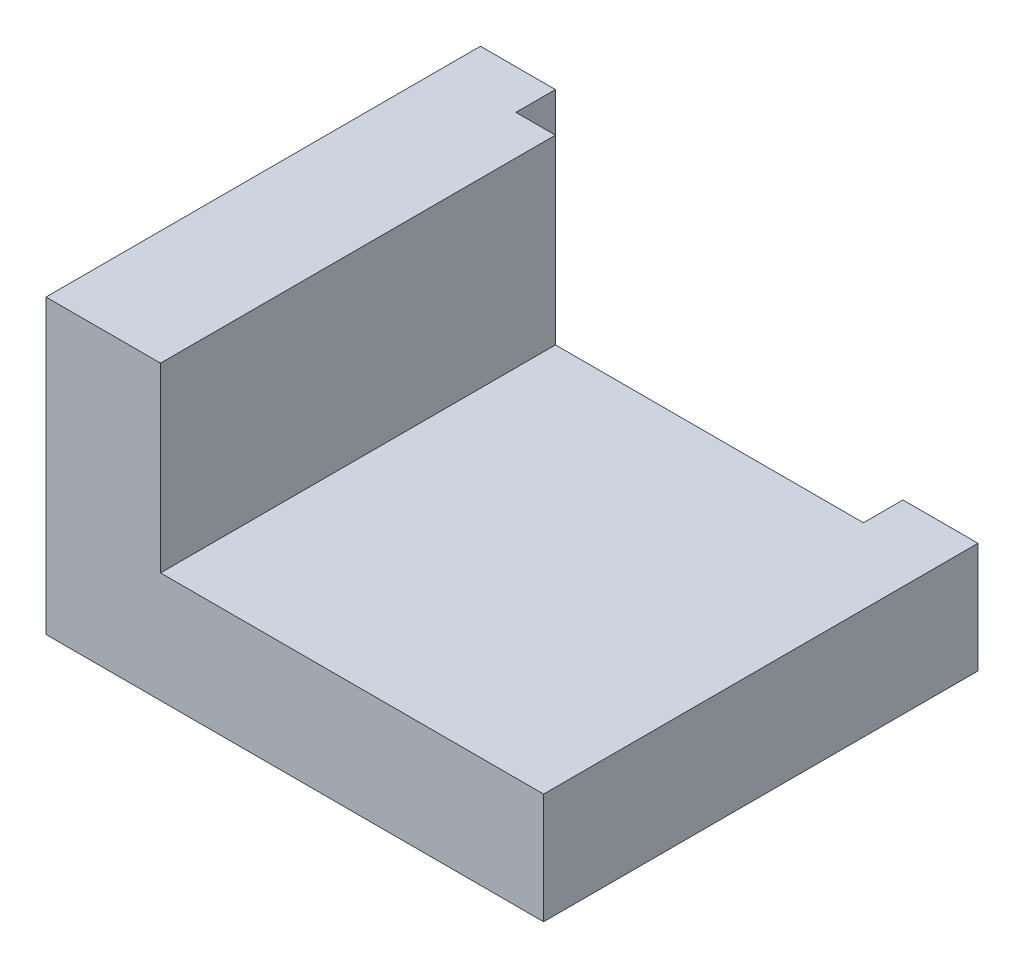
ISO-10303-21;
HEADER;
FILE_DESCRIPTION(('STEP AP214'),'2;1');
FILE_NAME('part.step','',(''),(''),'','','');
FILE_SCHEMA(('AUTOMOTIVE_DESIGN { 1 0 10303 214 1 1 1 1 }'));
ENDSEC;
DATA;
#1=APPLICATION_CONTEXT('core data for automotive mechanical design processes');
#2=APPLICATION_PROTOCOL_DEFINITION('international standard','automotive_design',2000,#1);
#3=PRODUCT_CONTEXT('',#1,'mechanical');
#4=PRODUCT('Part','Part','',(#3));
#5=PRODUCT_RELATED_PRODUCT_CATEGORY('part','',(#4));
#6=PRODUCT_DEFINITION_FORMATION('','',#4);
#7=PRODUCT_DEFINITION_CONTEXT('part definition',#1,'design');
#8=PRODUCT_DEFINITION('design','',#6,#7);
#9=PRODUCT_DEFINITION_SHAPE('','',#8);
#10=(LENGTH_UNIT() NAMED_UNIT(*) SI_UNIT(.MILLI.,.METRE.));
#11=(NAMED_UNIT(*) PLANE_ANGLE_UNIT() SI_UNIT($,.RADIAN.));
#12=(NAMED_UNIT(*) SI_UNIT($,.STERADIAN.) SOLID_ANGLE_UNIT());
#13=UNCERTAINTY_MEASURE_WITH_UNIT(LENGTH_MEASURE(1.E-05),#10,'distance_accuracy_value','');
#14=(GEOMETRIC_REPRESENTATION_CONTEXT(3) GLOBAL_UNCERTAINTY_ASSIGNED_CONTEXT((#13)) GLOBAL_UNIT_ASSIGNED_CONTEXT((#10,
#11,#12)) REPRESENTATION_CONTEXT('',''));
#15=CARTESIAN_POINT('',(0.,0.,0.));
#16=DIRECTION('',(0.,0.,1.));
#17=DIRECTION('',(1.,0.,0.));
#18=AXIS2_PLACEMENT_3D('',#15,#16,#17);
#19=CARTESIAN_POINT('',(63.,0.,5.));
#20=DIRECTION('',(0.,1.,0.));
#21=DIRECTION('',(-1.,0.,0.));
#22=AXIS2_PLACEMENT_3D('',#19,#20,#21);
#23=PLANE('',#22);
#24=DIRECTION('',(1.,0.,0.));
#25=VECTOR('',#24,1.);
#26=CARTESIAN_POINT('',(63.,0.,0.));
#27=LINE('',#26,#25);
#28=CARTESIAN_POINT('',(0.,0.,0.));
#29=VERTEX_POINT('',#28);
#30=CARTESIAN_POINT('',(63.,0.,0.));
#31=VERTEX_POINT('',#30);
#32=EDGE_CURVE('E160',#29,#31,#27,.T.);
#33=ORIENTED_EDGE('',*,*,#32,.T.);
#34=DIRECTION('',(0.,0.,-1.));
#35=VECTOR('',#34,1.);
#36=CARTESIAN_POINT('',(63.,0.,5.));
#37=LINE('',#36,#35);
#38=CARTESIAN_POINT('',(63.,0.,55.));
#39=VERTEX_POINT('',#38);
#40=EDGE_CURVE('E11',#39,#31,#37,.T.);
#41=ORIENTED_EDGE('',*,*,#40,.F.);
#42=DIRECTION('',(1.,0.,0.));
#43=VECTOR('',#42,1.);
#44=CARTESIAN_POINT('',(63.,0.,55.));
#45=LINE('',#44,#43);
#46=CARTESIAN_POINT('',(0.,0.,55.));
#47=VERTEX_POINT('',#46);
#48=EDGE_CURVE('E129',#47,#39,#45,.T.);
#49=ORIENTED_EDGE('',*,*,#48,.F.);
#50=DIRECTION('',(0.,0.,-1.));
#51=VECTOR('',#50,1.);
#52=CARTESIAN_POINT('',(0.,0.,5.));
#53=LINE('',#52,#51);
#54=EDGE_CURVE('E117',#47,#29,#53,.T.);
#55=ORIENTED_EDGE('',*,*,#54,.T.);
#56=EDGE_LOOP('',(#33,#41,#49,#55));
#57=FACE_BOUND('',#56,.T.);
#58=ADVANCED_FACE('F33',(#57),#23,.F.);
#59=CARTESIAN_POINT('',(63.,14.,5.));
#60=DIRECTION('',(-1.,0.,0.));
#61=DIRECTION('',(0.,0.,1.));
#62=AXIS2_PLACEMENT_3D('',#59,#60,#61);
#63=PLANE('',#62);
#64=DIRECTION('',(0.,1.,0.));
#65=VECTOR('',#64,1.);
#66=CARTESIAN_POINT('',(63.,14.,0.));
#67=LINE('',#66,#65);
#68=CARTESIAN_POINT('',(63.,14.,0.));
#69=VERTEX_POINT('',#68);
#70=EDGE_CURVE('E170',#31,#69,#67,.T.);
#71=ORIENTED_EDGE('',*,*,#70,.T.);
#72=DIRECTION('',(0.,0.,-1.));
#73=VECTOR('',#72,1.);
#74=CARTESIAN_POINT('',(63.,14.,5.));
#75=LINE('',#74,#73);
#76=CARTESIAN_POINT('',(63.,14.,55.));
#77=VERTEX_POINT('',#76);
#78=EDGE_CURVE('E41',#77,#69,#75,.T.);
#79=ORIENTED_EDGE('',*,*,#78,.F.);
#80=DIRECTION('',(0.,1.,0.));
#81=VECTOR('',#80,1.);
#82=CARTESIAN_POINT('',(63.,14.,55.));
#83=LINE('',#82,#81);
#84=EDGE_CURVE('E133',#39,#77,#83,.T.);
#85=ORIENTED_EDGE('',*,*,#84,.F.);
#86=ORIENTED_EDGE('',*,*,#40,.T.);
#87=EDGE_LOOP('',(#71,#79,#85,#86));
#88=FACE_BOUND('',#87,.T.);
#89=ADVANCED_FACE('F212',(#88),#63,.F.);
#90=CARTESIAN_POINT('',(53.5,14.,5.));
#91=DIRECTION('',(0.,-1.,0.));
#92=DIRECTION('',(1.,0.,0.));
#93=AXIS2_PLACEMENT_3D('',#90,#91,#92);
#94=PLANE('',#93);
#95=DIRECTION('',(-1.,0.,0.));
#96=VECTOR('',#95,1.);
#97=CARTESIAN_POINT('',(53.5,14.,0.));
#98=LINE('',#97,#96);
#99=CARTESIAN_POINT('',(53.5,14.,0.));
#100=VERTEX_POINT('',#99);
#101=EDGE_CURVE('E172',#69,#100,#98,.T.);
#102=ORIENTED_EDGE('',*,*,#101,.T.);
#103=DIRECTION('',(0.,0.,-1.));
#104=VECTOR('',#103,1.);
#105=CARTESIAN_POINT('',(53.5,14.,5.));
#106=LINE('',#105,#104);
#107=CARTESIAN_POINT('',(53.5,14.,5.));
#108=VERTEX_POINT('',#107);
#109=EDGE_CURVE('E91',#108,#100,#106,.T.);
#110=ORIENTED_EDGE('',*,*,#109,.F.);
#111=DIRECTION('',(-1.,0.,0.));
#112=VECTOR('',#111,1.);
#113=CARTESIAN_POINT('',(14.5,14.,5.));
#114=LINE('',#113,#112);
#115=CARTESIAN_POINT('',(14.5,14.,5.));
#116=VERTEX_POINT('',#115);
#117=EDGE_CURVE('E152',#108,#116,#114,.T.);
#118=ORIENTED_EDGE('',*,*,#117,.T.);
#119=DIRECTION('',(0.,0.,-1.));
#120=VECTOR('',#119,1.);
#121=CARTESIAN_POINT('',(14.5,14.,55.));
#122=LINE('',#121,#120);
#123=CARTESIAN_POINT('',(14.5,14.,55.));
#124=VERTEX_POINT('',#123);
#125=EDGE_CURVE('E157',#124,#116,#122,.T.);
#126=ORIENTED_EDGE('',*,*,#125,.F.);
#127=DIRECTION('',(-1.,0.,0.));
#128=VECTOR('',#127,1.);
#129=CARTESIAN_POINT('',(14.5,14.,55.));
#130=LINE('',#129,#128);
#131=EDGE_CURVE('E146',#77,#124,#130,.T.);
#132=ORIENTED_EDGE('',*,*,#131,.F.);
#133=ORIENTED_EDGE('',*,*,#78,.T.);
#134=EDGE_LOOP('',(#102,#110,#118,#126,#132,#133));
#135=FACE_BOUND('',#134,.T.);
#136=ADVANCED_FACE('F192',(#135),#94,.F.);
#137=CARTESIAN_POINT('',(53.5,3.99999999999999,5.));
#138=DIRECTION('',(1.,0.,0.));
#139=DIRECTION('',(0.,0.,-1.));
#140=AXIS2_PLACEMENT_3D('',#137,#138,#139);
#141=PLANE('',#140);
#142=DIRECTION('',(0.,-1.,0.));
#143=VECTOR('',#142,1.);
#144=CARTESIAN_POINT('',(53.5,3.99999999999999,0.));
#145=LINE('',#144,#143);
#146=CARTESIAN_POINT('',(53.5,3.99999999999999,0.));
#147=VERTEX_POINT('',#146);
#148=EDGE_CURVE('E174',#100,#147,#145,.T.);
#149=ORIENTED_EDGE('',*,*,#148,.T.);
#150=DIRECTION('',(0.,0.,-1.));
#151=VECTOR('',#150,1.);
#152=CARTESIAN_POINT('',(53.5,3.99999999999999,5.));
#153=LINE('',#152,#151);
#154=CARTESIAN_POINT('',(53.5,3.99999999999999,5.));
#155=VERTEX_POINT('',#154);
#156=EDGE_CURVE('E186',#155,#147,#153,.T.);
#157=ORIENTED_EDGE('',*,*,#156,.F.);
#158=DIRECTION('',(0.,-1.,0.));
#159=VECTOR('',#158,1.);
#160=CARTESIAN_POINT('',(53.5,3.99999999999999,5.));
#161=LINE('',#160,#159);
#162=EDGE_CURVE('E161',#108,#155,#161,.T.);
#163=ORIENTED_EDGE('',*,*,#162,.F.);
#164=ORIENTED_EDGE('',*,*,#109,.T.);
#165=EDGE_LOOP('',(#149,#157,#163,#164));
#166=FACE_BOUND('',#165,.T.);
#167=ADVANCED_FACE('F201',(#166),#141,.F.);
#168=CARTESIAN_POINT('',(9.5,3.99999999999999,5.));
#169=DIRECTION('',(0.,-1.,0.));
#170=DIRECTION('',(0.,0.,-1.));
#171=AXIS2_PLACEMENT_3D('',#168,#169,#170);
#172=PLANE('',#171);
#173=DIRECTION('',(-1.,0.,0.));
#174=VECTOR('',#173,1.);
#175=CARTESIAN_POINT('',(9.5,3.99999999999999,0.));
#176=LINE('',#175,#174);
#177=CARTESIAN_POINT('',(9.5,3.99999999999999,0.));
#178=VERTEX_POINT('',#177);
#179=EDGE_CURVE('E176',#147,#178,#176,.T.);
#180=ORIENTED_EDGE('',*,*,#179,.T.);
#181=DIRECTION('',(0.,0.,-1.));
#182=VECTOR('',#181,1.);
#183=CARTESIAN_POINT('',(9.5,3.99999999999999,5.));
#184=LINE('',#183,#182);
#185=CARTESIAN_POINT('',(9.5,3.99999999999999,5.));
#186=VERTEX_POINT('',#185);
#187=EDGE_CURVE('E49',#186,#178,#184,.T.);
#188=ORIENTED_EDGE('',*,*,#187,.F.);
#189=DIRECTION('',(-1.,0.,0.));
#190=VECTOR('',#189,1.);
#191=CARTESIAN_POINT('',(9.5,3.99999999999999,5.));
#192=LINE('',#191,#190);
#193=EDGE_CURVE('E164',#155,#186,#192,.T.);
#194=ORIENTED_EDGE('',*,*,#193,.F.);
#195=ORIENTED_EDGE('',*,*,#156,.T.);
#196=EDGE_LOOP('',(#180,#188,#194,#195));
#197=FACE_BOUND('',#196,.T.);
#198=ADVANCED_FACE('F202',(#197),#172,.F.);
#199=CARTESIAN_POINT('',(9.5,37.,5.));
#200=DIRECTION('',(-1.,0.,0.));
#201=DIRECTION('',(0.,-1.,0.));
#202=AXIS2_PLACEMENT_3D('',#199,#200,#201);
#203=PLANE('',#202);
#204=DIRECTION('',(0.,1.,0.));
#205=VECTOR('',#204,1.);
#206=CARTESIAN_POINT('',(9.5,37.,0.));
#207=LINE('',#206,#205);
#208=CARTESIAN_POINT('',(9.5,37.,0.));
#209=VERTEX_POINT('',#208);
#210=EDGE_CURVE('E178',#178,#209,#207,.T.);
#211=ORIENTED_EDGE('',*,*,#210,.T.);
#212=DIRECTION('',(0.,0.,-1.));
#213=VECTOR('',#212,1.);
#214=CARTESIAN_POINT('',(9.5,37.,5.));
#215=LINE('',#214,#213);
#216=CARTESIAN_POINT('',(9.5,37.,5.));
#217=VERTEX_POINT('',#216);
#218=EDGE_CURVE('E183',#217,#209,#215,.T.);
#219=ORIENTED_EDGE('',*,*,#218,.F.);
#220=DIRECTION('',(0.,1.,0.));
#221=VECTOR('',#220,1.);
#222=CARTESIAN_POINT('',(9.5,37.,5.));
#223=LINE('',#222,#221);
#224=EDGE_CURVE('E126',#186,#217,#223,.T.);
#225=ORIENTED_EDGE('',*,*,#224,.F.);
#226=ORIENTED_EDGE('',*,*,#187,.T.);
#227=EDGE_LOOP('',(#211,#219,#225,#226));
#228=FACE_BOUND('',#227,.T.);
#229=ADVANCED_FACE('F214',(#228),#203,.F.);
#230=CARTESIAN_POINT('',(0.,37.,5.));
#231=DIRECTION('',(0.,-1.,0.));
#232=DIRECTION('',(1.,0.,0.));
#233=AXIS2_PLACEMENT_3D('',#230,#231,#232);
#234=PLANE('',#233);
#235=DIRECTION('',(-1.,0.,0.));
#236=VECTOR('',#235,1.);
#237=CARTESIAN_POINT('',(0.,37.,0.));
#238=LINE('',#237,#236);
#239=CARTESIAN_POINT('',(0.,37.,0.));
#240=VERTEX_POINT('',#239);
#241=EDGE_CURVE('E79',#209,#240,#238,.T.);
#242=ORIENTED_EDGE('',*,*,#241,.T.);
#243=DIRECTION('',(0.,0.,-1.));
#244=VECTOR('',#243,1.);
#245=CARTESIAN_POINT('',(0.,37.,5.));
#246=LINE('',#245,#244);
#247=CARTESIAN_POINT('',(0.,37.,55.));
#248=VERTEX_POINT('',#247);
#249=EDGE_CURVE('E125',#248,#240,#246,.T.);
#250=ORIENTED_EDGE('',*,*,#249,.F.);
#251=DIRECTION('',(-1.,0.,0.));
#252=VECTOR('',#251,1.);
#253=CARTESIAN_POINT('',(0.,37.,55.));
#254=LINE('',#253,#252);
#255=CARTESIAN_POINT('',(14.5,37.,55.));
#256=VERTEX_POINT('',#255);
#257=EDGE_CURVE('E138',#256,#248,#254,.T.);
#258=ORIENTED_EDGE('',*,*,#257,.F.);
#259=DIRECTION('',(0.,0.,-1.));
#260=VECTOR('',#259,1.);
#261=CARTESIAN_POINT('',(14.5,37.,55.));
#262=LINE('',#261,#260);
#263=CARTESIAN_POINT('',(14.5,37.,5.));
#264=VERTEX_POINT('',#263);
#265=EDGE_CURVE('E151',#256,#264,#262,.T.);
#266=ORIENTED_EDGE('',*,*,#265,.T.);
#267=DIRECTION('',(-1.,0.,0.));
#268=VECTOR('',#267,1.);
#269=CARTESIAN_POINT('',(0.,37.,5.));
#270=LINE('',#269,#268);
#271=EDGE_CURVE('E139',#264,#217,#270,.T.);
#272=ORIENTED_EDGE('',*,*,#271,.T.);
#273=ORIENTED_EDGE('',*,*,#218,.T.);
#274=EDGE_LOOP('',(#242,#250,#258,#266,#272,#273));
#275=FACE_BOUND('',#274,.T.);
#276=ADVANCED_FACE('F215',(#275),#234,.F.);
#277=CARTESIAN_POINT('',(0.,0.,5.));
#278=DIRECTION('',(1.,0.,0.));
#279=DIRECTION('',(0.,0.,-1.));
#280=AXIS2_PLACEMENT_3D('',#277,#278,#279);
#281=PLANE('',#280);
#282=DIRECTION('',(0.,-1.,0.));
#283=VECTOR('',#282,1.);
#284=CARTESIAN_POINT('',(0.,0.,0.));
#285=LINE('',#284,#283);
#286=EDGE_CURVE('E85',#240,#29,#285,.T.);
#287=ORIENTED_EDGE('',*,*,#286,.T.);
#288=ORIENTED_EDGE('',*,*,#54,.F.);
#289=DIRECTION('',(0.,-1.,0.));
#290=VECTOR('',#289,1.);
#291=CARTESIAN_POINT('',(0.,0.,55.));
#292=LINE('',#291,#290);
#293=EDGE_CURVE('E121',#248,#47,#292,.T.);
#294=ORIENTED_EDGE('',*,*,#293,.F.);
#295=ORIENTED_EDGE('',*,*,#249,.T.);
#296=EDGE_LOOP('',(#287,#288,#294,#295));
#297=FACE_BOUND('',#296,.T.);
#298=ADVANCED_FACE('F119',(#297),#281,.F.);
#299=CARTESIAN_POINT('',(0.,0.,0.));
#300=DIRECTION('',(0.,0.,-1.));
#301=DIRECTION('',(-1.,0.,0.));
#302=AXIS2_PLACEMENT_3D('',#299,#300,#301);
#303=PLANE('',#302);
#304=ORIENTED_EDGE('',*,*,#32,.F.);
#305=ORIENTED_EDGE('',*,*,#286,.F.);
#306=ORIENTED_EDGE('',*,*,#241,.F.);
#307=ORIENTED_EDGE('',*,*,#210,.F.);
#308=ORIENTED_EDGE('',*,*,#179,.F.);
#309=ORIENTED_EDGE('',*,*,#148,.F.);
#310=ORIENTED_EDGE('',*,*,#101,.F.);
#311=ORIENTED_EDGE('',*,*,#70,.F.);
#312=EDGE_LOOP('',(#304,#305,#306,#307,#308,#309,#310,#311));
#313=FACE_BOUND('',#312,.T.);
#314=ADVANCED_FACE('F197',(#313),#303,.T.);
#315=CARTESIAN_POINT('',(14.5,37.,55.));
#316=DIRECTION('',(-1.,0.,0.));
#317=DIRECTION('',(0.,-1.,0.));
#318=AXIS2_PLACEMENT_3D('',#315,#316,#317);
#319=PLANE('',#318);
#320=DIRECTION('',(0.,1.,0.));
#321=VECTOR('',#320,1.);
#322=CARTESIAN_POINT('',(14.5,37.,5.));
#323=LINE('',#322,#321);
#324=EDGE_CURVE('E142',#116,#264,#323,.T.);
#325=ORIENTED_EDGE('',*,*,#324,.T.);
#326=ORIENTED_EDGE('',*,*,#265,.F.);
#327=DIRECTION('',(0.,1.,0.));
#328=VECTOR('',#327,1.);
#329=CARTESIAN_POINT('',(14.5,37.,55.));
#330=LINE('',#329,#328);
#331=EDGE_CURVE('E148',#124,#256,#330,.T.);
#332=ORIENTED_EDGE('',*,*,#331,.F.);
#333=ORIENTED_EDGE('',*,*,#125,.T.);
#334=EDGE_LOOP('',(#325,#326,#332,#333));
#335=FACE_BOUND('',#334,.T.);
#336=ADVANCED_FACE('F210',(#335),#319,.F.);
#337=CARTESIAN_POINT('',(0.,0.,55.));
#338=DIRECTION('',(0.,0.,-1.));
#339=DIRECTION('',(-1.,0.,0.));
#340=AXIS2_PLACEMENT_3D('',#337,#338,#339);
#341=PLANE('',#340);
#342=ORIENTED_EDGE('',*,*,#293,.T.);
#343=ORIENTED_EDGE('',*,*,#48,.T.);
#344=ORIENTED_EDGE('',*,*,#84,.T.);
#345=ORIENTED_EDGE('',*,*,#131,.T.);
#346=ORIENTED_EDGE('',*,*,#331,.T.);
#347=ORIENTED_EDGE('',*,*,#257,.T.);
#348=EDGE_LOOP('',(#342,#343,#344,#345,#346,#347));
#349=FACE_BOUND('',#348,.T.);
#350=ADVANCED_FACE('F136',(#349),#341,.F.);
#351=CARTESIAN_POINT('',(0.,0.,5.));
#352=DIRECTION('',(0.,0.,-1.));
#353=DIRECTION('',(-1.,0.,0.));
#354=AXIS2_PLACEMENT_3D('',#351,#352,#353);
#355=PLANE('',#354);
#356=ORIENTED_EDGE('',*,*,#117,.F.);
#357=ORIENTED_EDGE('',*,*,#162,.T.);
#358=ORIENTED_EDGE('',*,*,#193,.T.);
#359=ORIENTED_EDGE('',*,*,#224,.T.);
#360=ORIENTED_EDGE('',*,*,#271,.F.);
#361=ORIENTED_EDGE('',*,*,#324,.F.);
#362=EDGE_LOOP('',(#356,#357,#358,#359,#360,#361));
#363=FACE_BOUND('',#362,.T.);
#364=ADVANCED_FACE('F205',(#363),#355,.T.);
#365=CLOSED_SHELL('',(#58,#89,#136,#167,#198,#229,#276,#298,#314,#336,#350,#364));
#366=MANIFOLD_SOLID_BREP('B2',#365);
#367=ADVANCED_BREP_SHAPE_REPRESENTATION('',(#18,#366),#14);
#368=SHAPE_DEFINITION_REPRESENTATION(#9,#367);
ENDSEC;
END-ISO-10303-21;
